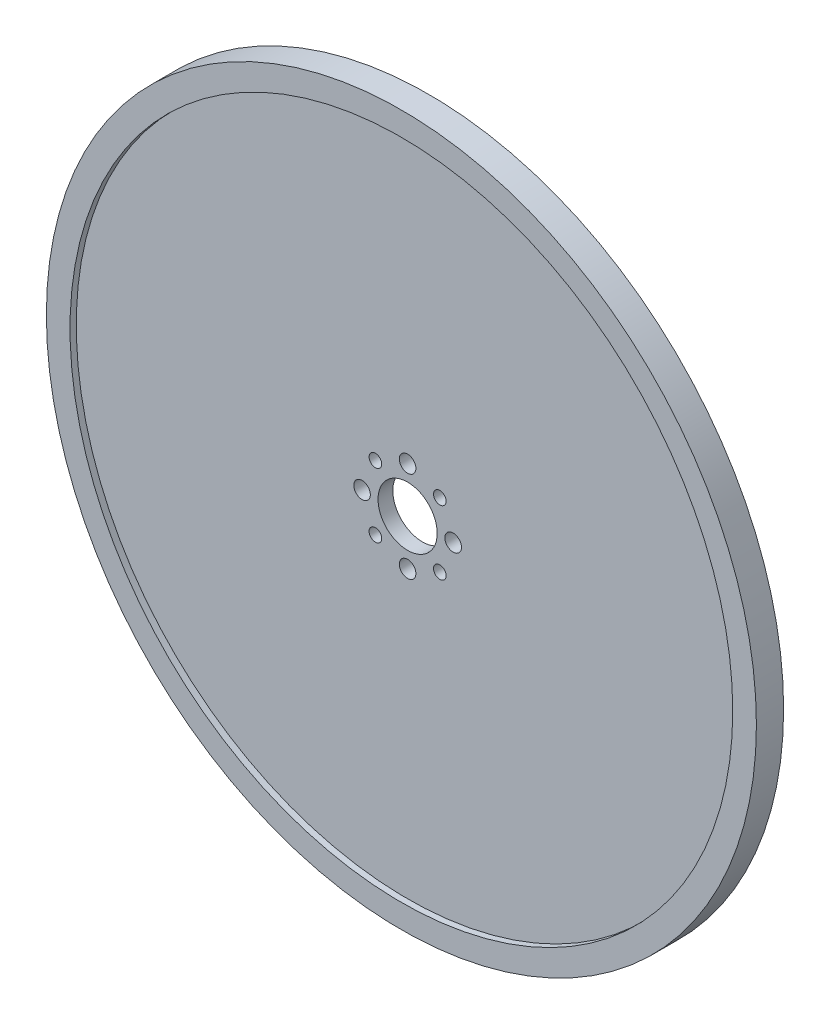
ISO-10303-21;
HEADER;
FILE_DESCRIPTION(('STEP AP214'),'2;1');
FILE_NAME('part.step','',(''),(''),'','','');
FILE_SCHEMA(('AUTOMOTIVE_DESIGN { 1 0 10303 214 1 1 1 1 }'));
ENDSEC;
DATA;
#1=APPLICATION_CONTEXT('core data for automotive mechanical design processes');
#2=APPLICATION_PROTOCOL_DEFINITION('international standard','automotive_design',2000,#1);
#3=PRODUCT_CONTEXT('',#1,'mechanical');
#4=PRODUCT('Part','Part','',(#3));
#5=PRODUCT_RELATED_PRODUCT_CATEGORY('part','',(#4));
#6=PRODUCT_DEFINITION_FORMATION('','',#4);
#7=PRODUCT_DEFINITION_CONTEXT('part definition',#1,'design');
#8=PRODUCT_DEFINITION('design','',#6,#7);
#9=PRODUCT_DEFINITION_SHAPE('','',#8);
#10=(LENGTH_UNIT() NAMED_UNIT(*) SI_UNIT(.MILLI.,.METRE.));
#11=(NAMED_UNIT(*) PLANE_ANGLE_UNIT() SI_UNIT($,.RADIAN.));
#12=(NAMED_UNIT(*) SI_UNIT($,.STERADIAN.) SOLID_ANGLE_UNIT());
#13=UNCERTAINTY_MEASURE_WITH_UNIT(LENGTH_MEASURE(1.E-05),#10,'distance_accuracy_value','');
#14=(GEOMETRIC_REPRESENTATION_CONTEXT(3) GLOBAL_UNCERTAINTY_ASSIGNED_CONTEXT((#13)) GLOBAL_UNIT_ASSIGNED_CONTEXT((#10,
#11,#12)) REPRESENTATION_CONTEXT('',''));
#15=CARTESIAN_POINT('',(0.,0.,0.));
#16=DIRECTION('',(0.,0.,1.));
#17=DIRECTION('',(1.,0.,0.));
#18=AXIS2_PLACEMENT_3D('',#15,#16,#17);
#19=CARTESIAN_POINT('',(0.,0.,2.921));
#20=DIRECTION('',(0.,0.,-1.));
#21=DIRECTION('',(-1.,0.,0.));
#22=AXIS2_PLACEMENT_3D('',#19,#20,#21);
#23=CYLINDRICAL_SURFACE('',#22,71.12);
#24=CARTESIAN_POINT('',(0.,0.,-2.921));
#25=DIRECTION('',(0.,0.,1.));
#26=DIRECTION('',(1.,0.,0.));
#27=AXIS2_PLACEMENT_3D('',#24,#25,#26);
#28=CIRCLE('',#27,71.12);
#29=CARTESIAN_POINT('',(71.12,0.,-2.921));
#30=VERTEX_POINT('',#29);
#31=EDGE_CURVE('E48',#30,#30,#28,.T.);
#32=ORIENTED_EDGE('',*,*,#31,.F.);
#33=EDGE_LOOP('',(#32));
#34=FACE_BOUND('',#33,.T.);
#35=CARTESIAN_POINT('',(0.,0.,-1.5875));
#36=DIRECTION('',(0.,0.,1.));
#37=DIRECTION('',(1.,0.,0.));
#38=AXIS2_PLACEMENT_3D('',#35,#36,#37);
#39=CIRCLE('',#38,71.12);
#40=CARTESIAN_POINT('',(71.12,0.,-1.5875));
#41=VERTEX_POINT('',#40);
#42=EDGE_CURVE('E51',#41,#41,#39,.T.);
#43=ORIENTED_EDGE('',*,*,#42,.T.);
#44=EDGE_LOOP('',(#43));
#45=FACE_BOUND('',#44,.T.);
#46=ADVANCED_FACE('F30',(#34,#45),#23,.F.);
#47=CARTESIAN_POINT('',(0.,0.,2.921));
#48=DIRECTION('',(0.,0.,1.));
#49=DIRECTION('',(1.,0.,0.));
#50=AXIS2_PLACEMENT_3D('',#47,#48,#49);
#51=PLANE('',#50);
#52=CARTESIAN_POINT('',(0.,0.,2.921));
#53=DIRECTION('',(0.,0.,1.));
#54=DIRECTION('',(1.,0.,0.));
#55=AXIS2_PLACEMENT_3D('',#52,#53,#54);
#56=CIRCLE('',#55,76.2);
#57=CARTESIAN_POINT('',(76.2,0.,2.921));
#58=VERTEX_POINT('',#57);
#59=EDGE_CURVE('E37',#58,#58,#56,.T.);
#60=ORIENTED_EDGE('',*,*,#59,.T.);
#61=EDGE_LOOP('',(#60));
#62=FACE_BOUND('',#61,.T.);
#63=CARTESIAN_POINT('',(0.,0.,2.921));
#64=DIRECTION('',(0.,0.,1.));
#65=DIRECTION('',(1.,0.,0.));
#66=AXIS2_PLACEMENT_3D('',#63,#64,#65);
#67=CIRCLE('',#66,71.12);
#68=CARTESIAN_POINT('',(71.12,0.,2.921));
#69=VERTEX_POINT('',#68);
#70=EDGE_CURVE('E46',#69,#69,#67,.T.);
#71=ORIENTED_EDGE('',*,*,#70,.F.);
#72=EDGE_LOOP('',(#71));
#73=FACE_BOUND('',#72,.T.);
#74=ADVANCED_FACE('F156',(#62,#73),#51,.T.);
#75=CARTESIAN_POINT('',(0.,0.,-2.921));
#76=DIRECTION('',(0.,0.,1.));
#77=DIRECTION('',(1.,0.,0.));
#78=AXIS2_PLACEMENT_3D('',#75,#76,#77);
#79=PLANE('',#78);
#80=CARTESIAN_POINT('',(0.,0.,-2.921));
#81=DIRECTION('',(0.,0.,1.));
#82=DIRECTION('',(1.,0.,0.));
#83=AXIS2_PLACEMENT_3D('',#80,#81,#82);
#84=CIRCLE('',#83,76.2);
#85=CARTESIAN_POINT('',(76.2,0.,-2.921));
#86=VERTEX_POINT('',#85);
#87=EDGE_CURVE('E41',#86,#86,#84,.T.);
#88=ORIENTED_EDGE('',*,*,#87,.F.);
#89=EDGE_LOOP('',(#88));
#90=FACE_BOUND('',#89,.T.);
#91=ORIENTED_EDGE('',*,*,#31,.T.);
#92=EDGE_LOOP('',(#91));
#93=FACE_BOUND('',#92,.T.);
#94=ADVANCED_FACE('F161',(#90,#93),#79,.F.);
#95=CARTESIAN_POINT('',(0.,0.,2.921));
#96=DIRECTION('',(0.,0.,-1.));
#97=DIRECTION('',(-1.,0.,0.));
#98=AXIS2_PLACEMENT_3D('',#95,#96,#97);
#99=CYLINDRICAL_SURFACE('',#98,76.2);
#100=ORIENTED_EDGE('',*,*,#59,.F.);
#101=EDGE_LOOP('',(#100));
#102=FACE_BOUND('',#101,.T.);
#103=ORIENTED_EDGE('',*,*,#87,.T.);
#104=EDGE_LOOP('',(#103));
#105=FACE_BOUND('',#104,.T.);
#106=ADVANCED_FACE('F32',(#102,#105),#99,.T.);
#107=CARTESIAN_POINT('',(0.,0.,1.5875));
#108=DIRECTION('',(0.,0.,1.));
#109=DIRECTION('',(1.,0.,0.));
#110=AXIS2_PLACEMENT_3D('',#107,#108,#109);
#111=CIRCLE('',#110,71.12);
#112=CARTESIAN_POINT('',(71.12,0.,1.5875));
#113=VERTEX_POINT('',#112);
#114=EDGE_CURVE('E10',#113,#113,#111,.T.);
#115=ORIENTED_EDGE('',*,*,#114,.F.);
#116=EDGE_LOOP('',(#115));
#117=FACE_BOUND('',#116,.T.);
#118=ORIENTED_EDGE('',*,*,#70,.T.);
#119=EDGE_LOOP('',(#118));
#120=FACE_BOUND('',#119,.T.);
#121=ADVANCED_FACE('F117',(#117,#120),#23,.F.);
#122=CARTESIAN_POINT('',(0.,0.,1.5875));
#123=DIRECTION('',(0.,0.,1.));
#124=DIRECTION('',(1.,0.,0.));
#125=AXIS2_PLACEMENT_3D('',#122,#123,#124);
#126=PLANE('',#125);
#127=CARTESIAN_POINT('',(-6.91479721322329,6.91479721322321,1.5875));
#128=DIRECTION('',(0.,0.,1.));
#129=DIRECTION('',(1.,0.,0.));
#130=AXIS2_PLACEMENT_3D('',#127,#128,#129);
#131=CIRCLE('',#130,1.35254999999999);
#132=CARTESIAN_POINT('',(-5.5622472132233,6.91479721322321,1.5875));
#133=VERTEX_POINT('',#132);
#134=EDGE_CURVE('E107',#133,#133,#131,.T.);
#135=ORIENTED_EDGE('',*,*,#134,.F.);
#136=EDGE_LOOP('',(#135));
#137=FACE_BOUND('',#136,.T.);
#138=CARTESIAN_POINT('',(6.91479721322325,6.91479721322344,1.5875));
#139=DIRECTION('',(0.,0.,1.));
#140=DIRECTION('',(1.,0.,0.));
#141=AXIS2_PLACEMENT_3D('',#138,#139,#140);
#142=CIRCLE('',#141,1.35254999999999);
#143=CARTESIAN_POINT('',(8.26734721322323,6.91479721322344,1.5875));
#144=VERTEX_POINT('',#143);
#145=EDGE_CURVE('E101',#144,#144,#142,.T.);
#146=ORIENTED_EDGE('',*,*,#145,.F.);
#147=EDGE_LOOP('',(#146));
#148=FACE_BOUND('',#147,.T.);
#149=CARTESIAN_POINT('',(6.91479721322344,-6.91479721322306,1.5875));
#150=DIRECTION('',(0.,0.,1.));
#151=DIRECTION('',(1.,0.,0.));
#152=AXIS2_PLACEMENT_3D('',#149,#150,#151);
#153=CIRCLE('',#152,1.35254999999999);
#154=CARTESIAN_POINT('',(8.26734721322343,-6.91479721322306,1.5875));
#155=VERTEX_POINT('',#154);
#156=EDGE_CURVE('E95',#155,#155,#153,.T.);
#157=ORIENTED_EDGE('',*,*,#156,.F.);
#158=EDGE_LOOP('',(#157));
#159=FACE_BOUND('',#158,.T.);
#160=CARTESIAN_POINT('',(-6.91479721322306,-6.91479721322325,1.5875));
#161=DIRECTION('',(0.,0.,1.));
#162=DIRECTION('',(1.,0.,0.));
#163=AXIS2_PLACEMENT_3D('',#160,#161,#162);
#164=CIRCLE('',#163,1.35254999999999);
#165=CARTESIAN_POINT('',(-5.56224721322307,-6.91479721322325,1.5875));
#166=VERTEX_POINT('',#165);
#167=EDGE_CURVE('E89',#166,#166,#164,.T.);
#168=ORIENTED_EDGE('',*,*,#167,.F.);
#169=EDGE_LOOP('',(#168));
#170=FACE_BOUND('',#169,.T.);
#171=CARTESIAN_POINT('',(0.,-9.779,1.5875));
#172=DIRECTION('',(0.,0.,1.));
#173=DIRECTION('',(1.,0.,0.));
#174=AXIS2_PLACEMENT_3D('',#171,#172,#173);
#175=CIRCLE('',#174,1.778);
#176=CARTESIAN_POINT('',(1.77799999999993,-9.779,1.5875));
#177=VERTEX_POINT('',#176);
#178=EDGE_CURVE('E72',#177,#177,#175,.T.);
#179=ORIENTED_EDGE('',*,*,#178,.F.);
#180=EDGE_LOOP('',(#179));
#181=FACE_BOUND('',#180,.T.);
#182=CARTESIAN_POINT('',(0.,9.779,1.5875));
#183=DIRECTION('',(0.,0.,1.));
#184=DIRECTION('',(1.,0.,0.));
#185=AXIS2_PLACEMENT_3D('',#182,#183,#184);
#186=CIRCLE('',#185,1.778);
#187=CARTESIAN_POINT('',(1.778,9.779,1.5875));
#188=VERTEX_POINT('',#187);
#189=EDGE_CURVE('E60',#188,#188,#186,.T.);
#190=ORIENTED_EDGE('',*,*,#189,.F.);
#191=EDGE_LOOP('',(#190));
#192=FACE_BOUND('',#191,.T.);
#193=ORIENTED_EDGE('',*,*,#114,.T.);
#194=EDGE_LOOP('',(#193));
#195=FACE_BOUND('',#194,.T.);
#196=CARTESIAN_POINT('',(0.,0.,1.5875));
#197=DIRECTION('',(0.,0.,1.));
#198=DIRECTION('',(1.,0.,0.));
#199=AXIS2_PLACEMENT_3D('',#196,#197,#198);
#200=CIRCLE('',#199,6.35);
#201=CARTESIAN_POINT('',(6.35,0.,1.5875));
#202=VERTEX_POINT('',#201);
#203=EDGE_CURVE('E56',#202,#202,#200,.T.);
#204=ORIENTED_EDGE('',*,*,#203,.F.);
#205=EDGE_LOOP('',(#204));
#206=FACE_BOUND('',#205,.T.);
#207=CARTESIAN_POINT('',(9.779,0.,1.5875));
#208=DIRECTION('',(0.,0.,1.));
#209=DIRECTION('',(1.,0.,0.));
#210=AXIS2_PLACEMENT_3D('',#207,#208,#209);
#211=CIRCLE('',#210,1.778);
#212=CARTESIAN_POINT('',(11.557,0.,1.5875));
#213=VERTEX_POINT('',#212);
#214=EDGE_CURVE('E66',#213,#213,#211,.T.);
#215=ORIENTED_EDGE('',*,*,#214,.F.);
#216=EDGE_LOOP('',(#215));
#217=FACE_BOUND('',#216,.T.);
#218=CARTESIAN_POINT('',(-9.779,1.02429588037641E-13,1.5875));
#219=DIRECTION('',(0.,0.,1.));
#220=DIRECTION('',(1.,0.,0.));
#221=AXIS2_PLACEMENT_3D('',#218,#219,#220);
#222=CIRCLE('',#221,1.778);
#223=CARTESIAN_POINT('',(-8.001,1.02429588037641E-13,1.5875));
#224=VERTEX_POINT('',#223);
#225=EDGE_CURVE('E78',#224,#224,#222,.T.);
#226=ORIENTED_EDGE('',*,*,#225,.F.);
#227=EDGE_LOOP('',(#226));
#228=FACE_BOUND('',#227,.T.);
#229=ADVANCED_FACE('F113',(#137,#148,#159,#170,#181,#192,#195,#206,#217,#228),#126,.T.);
#230=CARTESIAN_POINT('',(0.,0.,-1.5875));
#231=DIRECTION('',(0.,0.,1.));
#232=DIRECTION('',(1.,0.,0.));
#233=AXIS2_PLACEMENT_3D('',#230,#231,#232);
#234=PLANE('',#233);
#235=CARTESIAN_POINT('',(-6.91479721322329,6.91479721322321,-1.5875));
#236=DIRECTION('',(0.,0.,1.));
#237=DIRECTION('',(1.,0.,0.));
#238=AXIS2_PLACEMENT_3D('',#235,#236,#237);
#239=CIRCLE('',#238,1.35254999999999);
#240=CARTESIAN_POINT('',(-5.56224721322329,6.91479721322321,-1.5875));
#241=VERTEX_POINT('',#240);
#242=EDGE_CURVE('E104',#241,#241,#239,.T.);
#243=ORIENTED_EDGE('',*,*,#242,.T.);
#244=EDGE_LOOP('',(#243));
#245=FACE_BOUND('',#244,.T.);
#246=CARTESIAN_POINT('',(6.91479721322325,6.91479721322344,-1.5875));
#247=DIRECTION('',(0.,0.,1.));
#248=DIRECTION('',(1.,0.,0.));
#249=AXIS2_PLACEMENT_3D('',#246,#247,#248);
#250=CIRCLE('',#249,1.35254999999999);
#251=CARTESIAN_POINT('',(8.26734721322324,6.91479721322344,-1.5875));
#252=VERTEX_POINT('',#251);
#253=EDGE_CURVE('E98',#252,#252,#250,.T.);
#254=ORIENTED_EDGE('',*,*,#253,.T.);
#255=EDGE_LOOP('',(#254));
#256=FACE_BOUND('',#255,.T.);
#257=CARTESIAN_POINT('',(6.91479721322344,-6.91479721322306,-1.5875));
#258=DIRECTION('',(0.,0.,1.));
#259=DIRECTION('',(1.,0.,0.));
#260=AXIS2_PLACEMENT_3D('',#257,#258,#259);
#261=CIRCLE('',#260,1.35254999999999);
#262=CARTESIAN_POINT('',(8.26734721322343,-6.91479721322306,-1.5875));
#263=VERTEX_POINT('',#262);
#264=EDGE_CURVE('E92',#263,#263,#261,.T.);
#265=ORIENTED_EDGE('',*,*,#264,.T.);
#266=EDGE_LOOP('',(#265));
#267=FACE_BOUND('',#266,.T.);
#268=CARTESIAN_POINT('',(-6.91479721322306,-6.91479721322325,-1.5875));
#269=DIRECTION('',(0.,0.,1.));
#270=DIRECTION('',(1.,0.,0.));
#271=AXIS2_PLACEMENT_3D('',#268,#269,#270);
#272=CIRCLE('',#271,1.35254999999999);
#273=CARTESIAN_POINT('',(-5.56224721322306,-6.91479721322325,-1.5875));
#274=VERTEX_POINT('',#273);
#275=EDGE_CURVE('E84',#274,#274,#272,.T.);
#276=ORIENTED_EDGE('',*,*,#275,.T.);
#277=EDGE_LOOP('',(#276));
#278=FACE_BOUND('',#277,.T.);
#279=CARTESIAN_POINT('',(0.,-9.779,-1.5875));
#280=DIRECTION('',(0.,0.,1.));
#281=DIRECTION('',(1.,0.,0.));
#282=AXIS2_PLACEMENT_3D('',#279,#280,#281);
#283=CIRCLE('',#282,1.778);
#284=CARTESIAN_POINT('',(1.77799999999993,-9.779,-1.5875));
#285=VERTEX_POINT('',#284);
#286=EDGE_CURVE('E75',#285,#285,#283,.T.);
#287=ORIENTED_EDGE('',*,*,#286,.T.);
#288=EDGE_LOOP('',(#287));
#289=FACE_BOUND('',#288,.T.);
#290=CARTESIAN_POINT('',(0.,9.779,-1.5875));
#291=DIRECTION('',(0.,0.,1.));
#292=DIRECTION('',(1.,0.,0.));
#293=AXIS2_PLACEMENT_3D('',#290,#291,#292);
#294=CIRCLE('',#293,1.778);
#295=CARTESIAN_POINT('',(1.778,9.779,-1.5875));
#296=VERTEX_POINT('',#295);
#297=EDGE_CURVE('E63',#296,#296,#294,.T.);
#298=ORIENTED_EDGE('',*,*,#297,.T.);
#299=EDGE_LOOP('',(#298));
#300=FACE_BOUND('',#299,.T.);
#301=ORIENTED_EDGE('',*,*,#42,.F.);
#302=EDGE_LOOP('',(#301));
#303=FACE_BOUND('',#302,.T.);
#304=CARTESIAN_POINT('',(0.,0.,-1.5875));
#305=DIRECTION('',(0.,0.,1.));
#306=DIRECTION('',(1.,0.,0.));
#307=AXIS2_PLACEMENT_3D('',#304,#305,#306);
#308=CIRCLE('',#307,6.35);
#309=CARTESIAN_POINT('',(6.35,0.,-1.5875));
#310=VERTEX_POINT('',#309);
#311=EDGE_CURVE('E57',#310,#310,#308,.T.);
#312=ORIENTED_EDGE('',*,*,#311,.T.);
#313=EDGE_LOOP('',(#312));
#314=FACE_BOUND('',#313,.T.);
#315=CARTESIAN_POINT('',(9.779,0.,-1.5875));
#316=DIRECTION('',(0.,0.,1.));
#317=DIRECTION('',(1.,0.,0.));
#318=AXIS2_PLACEMENT_3D('',#315,#316,#317);
#319=CIRCLE('',#318,1.778);
#320=CARTESIAN_POINT('',(11.557,0.,-1.5875));
#321=VERTEX_POINT('',#320);
#322=EDGE_CURVE('E69',#321,#321,#319,.T.);
#323=ORIENTED_EDGE('',*,*,#322,.T.);
#324=EDGE_LOOP('',(#323));
#325=FACE_BOUND('',#324,.T.);
#326=CARTESIAN_POINT('',(-9.779,1.02429588037641E-13,-1.5875));
#327=DIRECTION('',(0.,0.,1.));
#328=DIRECTION('',(1.,0.,0.));
#329=AXIS2_PLACEMENT_3D('',#326,#327,#328);
#330=CIRCLE('',#329,1.778);
#331=CARTESIAN_POINT('',(-8.001,1.02429588037641E-13,-1.5875));
#332=VERTEX_POINT('',#331);
#333=EDGE_CURVE('E81',#332,#332,#330,.T.);
#334=ORIENTED_EDGE('',*,*,#333,.T.);
#335=EDGE_LOOP('',(#334));
#336=FACE_BOUND('',#335,.T.);
#337=ADVANCED_FACE('F116',(#245,#256,#267,#278,#289,#300,#303,#314,#325,#336),#234,.F.);
#338=CARTESIAN_POINT('',(0.,0.,1.5875));
#339=DIRECTION('',(0.,0.,-1.));
#340=DIRECTION('',(-1.,0.,0.));
#341=AXIS2_PLACEMENT_3D('',#338,#339,#340);
#342=CYLINDRICAL_SURFACE('',#341,6.35);
#343=ORIENTED_EDGE('',*,*,#203,.T.);
#344=EDGE_LOOP('',(#343));
#345=FACE_BOUND('',#344,.T.);
#346=ORIENTED_EDGE('',*,*,#311,.F.);
#347=EDGE_LOOP('',(#346));
#348=FACE_BOUND('',#347,.T.);
#349=ADVANCED_FACE('F144',(#345,#348),#342,.F.);
#350=CARTESIAN_POINT('',(0.,9.779,1.5875));
#351=DIRECTION('',(0.,0.,-1.));
#352=DIRECTION('',(-1.,0.,0.));
#353=AXIS2_PLACEMENT_3D('',#350,#351,#352);
#354=CYLINDRICAL_SURFACE('',#353,1.778);
#355=ORIENTED_EDGE('',*,*,#189,.T.);
#356=EDGE_LOOP('',(#355));
#357=FACE_BOUND('',#356,.T.);
#358=ORIENTED_EDGE('',*,*,#297,.F.);
#359=EDGE_LOOP('',(#358));
#360=FACE_BOUND('',#359,.T.);
#361=ADVANCED_FACE('F150',(#357,#360),#354,.F.);
#362=CARTESIAN_POINT('',(9.779,0.,1.5875));
#363=DIRECTION('',(0.,0.,-1.));
#364=DIRECTION('',(-1.,0.,0.));
#365=AXIS2_PLACEMENT_3D('',#362,#363,#364);
#366=CYLINDRICAL_SURFACE('',#365,1.778);
#367=ORIENTED_EDGE('',*,*,#214,.T.);
#368=EDGE_LOOP('',(#367));
#369=FACE_BOUND('',#368,.T.);
#370=ORIENTED_EDGE('',*,*,#322,.F.);
#371=EDGE_LOOP('',(#370));
#372=FACE_BOUND('',#371,.T.);
#373=ADVANCED_FACE('F227',(#369,#372),#366,.F.);
#374=CARTESIAN_POINT('',(0.,-9.779,1.5875));
#375=DIRECTION('',(0.,0.,-1.));
#376=DIRECTION('',(-1.,0.,0.));
#377=AXIS2_PLACEMENT_3D('',#374,#375,#376);
#378=CYLINDRICAL_SURFACE('',#377,1.778);
#379=ORIENTED_EDGE('',*,*,#178,.T.);
#380=EDGE_LOOP('',(#379));
#381=FACE_BOUND('',#380,.T.);
#382=ORIENTED_EDGE('',*,*,#286,.F.);
#383=EDGE_LOOP('',(#382));
#384=FACE_BOUND('',#383,.T.);
#385=ADVANCED_FACE('F139',(#381,#384),#378,.F.);
#386=CARTESIAN_POINT('',(-9.779,1.02429588037641E-13,1.5875));
#387=DIRECTION('',(0.,0.,-1.));
#388=DIRECTION('',(-1.,0.,0.));
#389=AXIS2_PLACEMENT_3D('',#386,#387,#388);
#390=CYLINDRICAL_SURFACE('',#389,1.778);
#391=ORIENTED_EDGE('',*,*,#225,.T.);
#392=EDGE_LOOP('',(#391));
#393=FACE_BOUND('',#392,.T.);
#394=ORIENTED_EDGE('',*,*,#333,.F.);
#395=EDGE_LOOP('',(#394));
#396=FACE_BOUND('',#395,.T.);
#397=ADVANCED_FACE('F135',(#393,#396),#390,.F.);
#398=CARTESIAN_POINT('',(-6.91479721322306,-6.91479721322325,1.5875));
#399=DIRECTION('',(0.,0.,1.));
#400=DIRECTION('',(1.,0.,0.));
#401=AXIS2_PLACEMENT_3D('',#398,#399,#400);
#402=CYLINDRICAL_SURFACE('',#401,1.35254999999999);
#403=ORIENTED_EDGE('',*,*,#275,.F.);
#404=EDGE_LOOP('',(#403));
#405=FACE_BOUND('',#404,.T.);
#406=ORIENTED_EDGE('',*,*,#167,.T.);
#407=EDGE_LOOP('',(#406));
#408=FACE_BOUND('',#407,.T.);
#409=ADVANCED_FACE('F138',(#405,#408),#402,.F.);
#410=CARTESIAN_POINT('',(6.91479721322344,-6.91479721322306,1.5875));
#411=DIRECTION('',(0.,0.,1.));
#412=DIRECTION('',(1.,0.,0.));
#413=AXIS2_PLACEMENT_3D('',#410,#411,#412);
#414=CYLINDRICAL_SURFACE('',#413,1.35254999999999);
#415=ORIENTED_EDGE('',*,*,#264,.F.);
#416=EDGE_LOOP('',(#415));
#417=FACE_BOUND('',#416,.T.);
#418=ORIENTED_EDGE('',*,*,#156,.T.);
#419=EDGE_LOOP('',(#418));
#420=FACE_BOUND('',#419,.T.);
#421=ADVANCED_FACE('F255',(#417,#420),#414,.F.);
#422=CARTESIAN_POINT('',(6.91479721322325,6.91479721322344,1.5875));
#423=DIRECTION('',(0.,0.,1.));
#424=DIRECTION('',(1.,0.,0.));
#425=AXIS2_PLACEMENT_3D('',#422,#423,#424);
#426=CYLINDRICAL_SURFACE('',#425,1.35254999999999);
#427=ORIENTED_EDGE('',*,*,#253,.F.);
#428=EDGE_LOOP('',(#427));
#429=FACE_BOUND('',#428,.T.);
#430=ORIENTED_EDGE('',*,*,#145,.T.);
#431=EDGE_LOOP('',(#430));
#432=FACE_BOUND('',#431,.T.);
#433=ADVANCED_FACE('F264',(#429,#432),#426,.F.);
#434=CARTESIAN_POINT('',(-6.91479721322329,6.91479721322321,1.5875));
#435=DIRECTION('',(0.,0.,1.));
#436=DIRECTION('',(1.,0.,0.));
#437=AXIS2_PLACEMENT_3D('',#434,#435,#436);
#438=CYLINDRICAL_SURFACE('',#437,1.35254999999999);
#439=ORIENTED_EDGE('',*,*,#242,.F.);
#440=EDGE_LOOP('',(#439));
#441=FACE_BOUND('',#440,.T.);
#442=ORIENTED_EDGE('',*,*,#134,.T.);
#443=EDGE_LOOP('',(#442));
#444=FACE_BOUND('',#443,.T.);
#445=ADVANCED_FACE('F111',(#441,#444),#438,.F.);
#446=CLOSED_SHELL('',(#46,#74,#94,#106,#121,#229,#337,#349,#361,#373,#385,#397,#409,#421,#433,#445));
#447=MANIFOLD_SOLID_BREP('B2',#446);
#448=ADVANCED_BREP_SHAPE_REPRESENTATION('',(#18,#447),#14);
#449=SHAPE_DEFINITION_REPRESENTATION(#9,#448);
ENDSEC;
END-ISO-10303-21;
